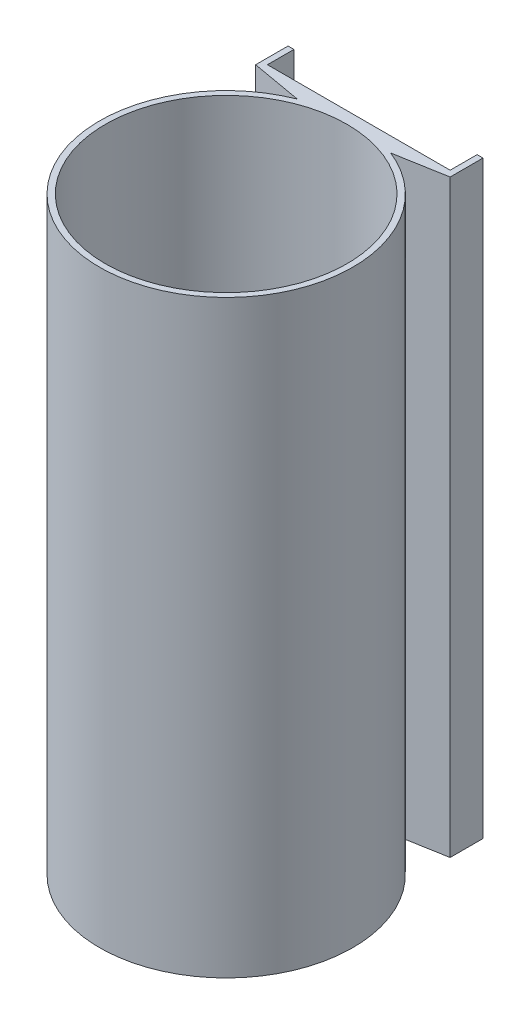
ISO-10303-21;
HEADER;
FILE_DESCRIPTION(('STEP AP214'),'2;1');
FILE_NAME('part.step','',(''),(''),'','','');
FILE_SCHEMA(('AUTOMOTIVE_DESIGN { 1 0 10303 214 1 1 1 1 }'));
ENDSEC;
DATA;
#1=APPLICATION_CONTEXT('core data for automotive mechanical design processes');
#2=APPLICATION_PROTOCOL_DEFINITION('international standard','automotive_design',2000,#1);
#3=PRODUCT_CONTEXT('',#1,'mechanical');
#4=PRODUCT('Part','Part','',(#3));
#5=PRODUCT_RELATED_PRODUCT_CATEGORY('part','',(#4));
#6=PRODUCT_DEFINITION_FORMATION('','',#4);
#7=PRODUCT_DEFINITION_CONTEXT('part definition',#1,'design');
#8=PRODUCT_DEFINITION('design','',#6,#7);
#9=PRODUCT_DEFINITION_SHAPE('','',#8);
#10=(LENGTH_UNIT() NAMED_UNIT(*) SI_UNIT(.MILLI.,.METRE.));
#11=(NAMED_UNIT(*) PLANE_ANGLE_UNIT() SI_UNIT($,.RADIAN.));
#12=(NAMED_UNIT(*) SI_UNIT($,.STERADIAN.) SOLID_ANGLE_UNIT());
#13=UNCERTAINTY_MEASURE_WITH_UNIT(LENGTH_MEASURE(1.E-05),#10,'distance_accuracy_value','');
#14=(GEOMETRIC_REPRESENTATION_CONTEXT(3) GLOBAL_UNCERTAINTY_ASSIGNED_CONTEXT((#13)) GLOBAL_UNIT_ASSIGNED_CONTEXT((#10,
#11,#12)) REPRESENTATION_CONTEXT('',''));
#15=CARTESIAN_POINT('',(0.,0.,0.));
#16=DIRECTION('',(0.,0.,1.));
#17=DIRECTION('',(1.,0.,0.));
#18=AXIS2_PLACEMENT_3D('',#15,#16,#17);
#19=CARTESIAN_POINT('',(6.35836132446917,200.,-36.0600589820238));
#20=DIRECTION('',(0.173648177666924,0.,-0.984807753012209));
#21=DIRECTION('',(-0.984807753012209,0.,-0.173648177666924));
#22=AXIS2_PLACEMENT_3D('',#19,#20,#21);
#23=PLANE('',#22);
#24=DIRECTION('',(0.984807753012209,0.,0.173648177666924));
#25=VECTOR('',#24,1.);
#26=CARTESIAN_POINT('',(6.35836132446917,0.,-36.0600589820238));
#27=LINE('',#26,#25);
#28=CARTESIAN_POINT('',(-33.,0.,-43.));
#29=VERTEX_POINT('',#28);
#30=CARTESIAN_POINT('',(-15.8433947801623,0.,-39.974827602379));
#31=VERTEX_POINT('',#30);
#32=EDGE_CURVE('E154',#29,#31,#27,.T.);
#33=ORIENTED_EDGE('',*,*,#32,.T.);
#34=DIRECTION('',(0.,-1.,0.));
#35=VECTOR('',#34,1.);
#36=CARTESIAN_POINT('',(-15.8433947801623,200.,-39.974827602379));
#37=LINE('',#36,#35);
#38=CARTESIAN_POINT('',(-15.8433947801623,200.,-39.974827602379));
#39=VERTEX_POINT('',#38);
#40=EDGE_CURVE('E11',#39,#31,#37,.T.);
#41=ORIENTED_EDGE('',*,*,#40,.F.);
#42=DIRECTION('',(0.984807753012209,0.,0.173648177666924));
#43=VECTOR('',#42,1.);
#44=CARTESIAN_POINT('',(6.35836132446917,200.,-36.0600589820238));
#45=LINE('',#44,#43);
#46=CARTESIAN_POINT('',(-33.,200.,-43.));
#47=VERTEX_POINT('',#46);
#48=EDGE_CURVE('E183',#47,#39,#45,.T.);
#49=ORIENTED_EDGE('',*,*,#48,.F.);
#50=DIRECTION('',(0.,-1.,0.));
#51=VECTOR('',#50,1.);
#52=CARTESIAN_POINT('',(-33.,200.,-43.));
#53=LINE('',#52,#51);
#54=EDGE_CURVE('E57',#47,#29,#53,.T.);
#55=ORIENTED_EDGE('',*,*,#54,.T.);
#56=EDGE_LOOP('',(#33,#41,#49,#55));
#57=FACE_BOUND('',#56,.T.);
#58=ADVANCED_FACE('F41',(#57),#23,.F.);
#59=CARTESIAN_POINT('',(0.,200.,0.));
#60=DIRECTION('',(0.,-1.,0.));
#61=DIRECTION('',(0.,0.,-1.));
#62=AXIS2_PLACEMENT_3D('',#59,#60,#61);
#63=CYLINDRICAL_SURFACE('',#62,43.);
#64=CARTESIAN_POINT('',(0.,0.,0.));
#65=DIRECTION('',(0.,1.,0.));
#66=DIRECTION('',(0.,0.,1.));
#67=AXIS2_PLACEMENT_3D('',#64,#65,#66);
#68=CIRCLE('',#67,43.);
#69=CARTESIAN_POINT('',(15.8433947801623,0.,-39.974827602379));
#70=VERTEX_POINT('',#69);
#71=EDGE_CURVE('E156',#31,#70,#68,.T.);
#72=ORIENTED_EDGE('',*,*,#71,.T.);
#73=DIRECTION('',(0.,-1.,0.));
#74=VECTOR('',#73,1.);
#75=CARTESIAN_POINT('',(15.8433947801623,200.,-39.974827602379));
#76=LINE('',#75,#74);
#77=CARTESIAN_POINT('',(15.8433947801623,200.,-39.974827602379));
#78=VERTEX_POINT('',#77);
#79=EDGE_CURVE('E49',#78,#70,#76,.T.);
#80=ORIENTED_EDGE('',*,*,#79,.F.);
#81=CARTESIAN_POINT('',(0.,200.,0.));
#82=DIRECTION('',(0.,1.,0.));
#83=DIRECTION('',(0.,0.,1.));
#84=AXIS2_PLACEMENT_3D('',#81,#82,#83);
#85=CIRCLE('',#84,43.);
#86=EDGE_CURVE('E101',#39,#78,#85,.T.);
#87=ORIENTED_EDGE('',*,*,#86,.F.);
#88=ORIENTED_EDGE('',*,*,#40,.T.);
#89=EDGE_LOOP('',(#72,#80,#87,#88));
#90=FACE_BOUND('',#89,.T.);
#91=ADVANCED_FACE('F200',(#90),#63,.T.);
#92=CARTESIAN_POINT('',(-6.35836132446918,200.,-36.0600589820238));
#93=DIRECTION('',(0.173648177666924,0.,0.984807753012209));
#94=DIRECTION('',(0.984807753012209,0.,-0.173648177666924));
#95=AXIS2_PLACEMENT_3D('',#92,#93,#94);
#96=PLANE('',#95);
#97=DIRECTION('',(-0.984807753012209,0.,0.173648177666924));
#98=VECTOR('',#97,1.);
#99=CARTESIAN_POINT('',(-6.35836132446918,0.,-36.0600589820238));
#100=LINE('',#99,#98);
#101=CARTESIAN_POINT('',(33.,0.,-43.));
#102=VERTEX_POINT('',#101);
#103=EDGE_CURVE('E159',#102,#70,#100,.T.);
#104=ORIENTED_EDGE('',*,*,#103,.F.);
#105=DIRECTION('',(0.,-1.,0.));
#106=VECTOR('',#105,1.);
#107=CARTESIAN_POINT('',(33.,200.,-43.));
#108=LINE('',#107,#106);
#109=CARTESIAN_POINT('',(33.,200.,-43.));
#110=VERTEX_POINT('',#109);
#111=EDGE_CURVE('E193',#110,#102,#108,.T.);
#112=ORIENTED_EDGE('',*,*,#111,.F.);
#113=DIRECTION('',(-0.984807753012209,0.,0.173648177666924));
#114=VECTOR('',#113,1.);
#115=CARTESIAN_POINT('',(-6.35836132446918,200.,-36.0600589820238));
#116=LINE('',#115,#114);
#117=EDGE_CURVE('E199',#110,#78,#116,.T.);
#118=ORIENTED_EDGE('',*,*,#117,.T.);
#119=ORIENTED_EDGE('',*,*,#79,.T.);
#120=EDGE_LOOP('',(#104,#112,#118,#119));
#121=FACE_BOUND('',#120,.T.);
#122=ADVANCED_FACE('F197',(#121),#96,.T.);
#123=CARTESIAN_POINT('',(33.,200.,0.));
#124=DIRECTION('',(-1.,0.,0.));
#125=DIRECTION('',(0.,0.,1.));
#126=AXIS2_PLACEMENT_3D('',#123,#124,#125);
#127=PLANE('',#126);
#128=DIRECTION('',(0.,0.,-1.));
#129=VECTOR('',#128,1.);
#130=CARTESIAN_POINT('',(33.,0.,0.));
#131=LINE('',#130,#129);
#132=CARTESIAN_POINT('',(33.,0.,-54.1590723886463));
#133=VERTEX_POINT('',#132);
#134=EDGE_CURVE('E162',#102,#133,#131,.T.);
#135=ORIENTED_EDGE('',*,*,#134,.T.);
#136=DIRECTION('',(0.,-1.,0.));
#137=VECTOR('',#136,1.);
#138=CARTESIAN_POINT('',(33.,200.,-54.1590723886463));
#139=LINE('',#138,#137);
#140=CARTESIAN_POINT('',(33.,200.,-54.1590723886463));
#141=VERTEX_POINT('',#140);
#142=EDGE_CURVE('E191',#141,#133,#139,.T.);
#143=ORIENTED_EDGE('',*,*,#142,.F.);
#144=DIRECTION('',(0.,0.,-1.));
#145=VECTOR('',#144,1.);
#146=CARTESIAN_POINT('',(33.,200.,0.));
#147=LINE('',#146,#145);
#148=EDGE_CURVE('E212',#110,#141,#147,.T.);
#149=ORIENTED_EDGE('',*,*,#148,.F.);
#150=ORIENTED_EDGE('',*,*,#111,.T.);
#151=EDGE_LOOP('',(#135,#143,#149,#150));
#152=FACE_BOUND('',#151,.T.);
#153=ADVANCED_FACE('F209',(#152),#127,.F.);
#154=CARTESIAN_POINT('',(0.,200.,-54.1590723886463));
#155=DIRECTION('',(0.,0.,-1.));
#156=DIRECTION('',(-1.,0.,0.));
#157=AXIS2_PLACEMENT_3D('',#154,#155,#156);
#158=PLANE('',#157);
#159=DIRECTION('',(1.,0.,0.));
#160=VECTOR('',#159,1.);
#161=CARTESIAN_POINT('',(0.,0.,-54.1590723886463));
#162=LINE('',#161,#160);
#163=CARTESIAN_POINT('',(31.,0.,-54.1590723886463));
#164=VERTEX_POINT('',#163);
#165=EDGE_CURVE('E165',#164,#133,#162,.T.);
#166=ORIENTED_EDGE('',*,*,#165,.F.);
#167=DIRECTION('',(0.,-1.,0.));
#168=VECTOR('',#167,1.);
#169=CARTESIAN_POINT('',(31.,200.,-54.1590723886463));
#170=LINE('',#169,#168);
#171=CARTESIAN_POINT('',(31.,200.,-54.1590723886463));
#172=VERTEX_POINT('',#171);
#173=EDGE_CURVE('E189',#172,#164,#170,.T.);
#174=ORIENTED_EDGE('',*,*,#173,.F.);
#175=DIRECTION('',(1.,0.,0.));
#176=VECTOR('',#175,1.);
#177=CARTESIAN_POINT('',(0.,200.,-54.1590723886463));
#178=LINE('',#177,#176);
#179=EDGE_CURVE('E214',#172,#141,#178,.T.);
#180=ORIENTED_EDGE('',*,*,#179,.T.);
#181=ORIENTED_EDGE('',*,*,#142,.T.);
#182=EDGE_LOOP('',(#166,#174,#180,#181));
#183=FACE_BOUND('',#182,.T.);
#184=ADVANCED_FACE('F249',(#183),#158,.T.);
#185=CARTESIAN_POINT('',(31.,200.,0.));
#186=DIRECTION('',(-1.,0.,0.));
#187=DIRECTION('',(0.,0.,1.));
#188=AXIS2_PLACEMENT_3D('',#185,#186,#187);
#189=PLANE('',#188);
#190=DIRECTION('',(0.,0.,-1.));
#191=VECTOR('',#190,1.);
#192=CARTESIAN_POINT('',(31.,0.,0.));
#193=LINE('',#192,#191);
#194=CARTESIAN_POINT('',(31.,0.,-45.));
#195=VERTEX_POINT('',#194);
#196=EDGE_CURVE('E168',#195,#164,#193,.T.);
#197=ORIENTED_EDGE('',*,*,#196,.F.);
#198=DIRECTION('',(0.,-1.,0.));
#199=VECTOR('',#198,1.);
#200=CARTESIAN_POINT('',(31.,200.,-45.));
#201=LINE('',#200,#199);
#202=CARTESIAN_POINT('',(31.,200.,-45.));
#203=VERTEX_POINT('',#202);
#204=EDGE_CURVE('E187',#203,#195,#201,.T.);
#205=ORIENTED_EDGE('',*,*,#204,.F.);
#206=DIRECTION('',(0.,0.,-1.));
#207=VECTOR('',#206,1.);
#208=CARTESIAN_POINT('',(31.,200.,0.));
#209=LINE('',#208,#207);
#210=EDGE_CURVE('E221',#203,#172,#209,.T.);
#211=ORIENTED_EDGE('',*,*,#210,.T.);
#212=ORIENTED_EDGE('',*,*,#173,.T.);
#213=EDGE_LOOP('',(#197,#205,#211,#212));
#214=FACE_BOUND('',#213,.T.);
#215=ADVANCED_FACE('F252',(#214),#189,.T.);
#216=CARTESIAN_POINT('',(0.,200.,-45.));
#217=DIRECTION('',(0.,0.,-1.));
#218=DIRECTION('',(-1.,0.,0.));
#219=AXIS2_PLACEMENT_3D('',#216,#217,#218);
#220=PLANE('',#219);
#221=DIRECTION('',(1.,0.,0.));
#222=VECTOR('',#221,1.);
#223=CARTESIAN_POINT('',(0.,0.,-45.));
#224=LINE('',#223,#222);
#225=CARTESIAN_POINT('',(-31.,0.,-45.));
#226=VERTEX_POINT('',#225);
#227=EDGE_CURVE('E171',#226,#195,#224,.T.);
#228=ORIENTED_EDGE('',*,*,#227,.F.);
#229=DIRECTION('',(0.,-1.,0.));
#230=VECTOR('',#229,1.);
#231=CARTESIAN_POINT('',(-31.,200.,-45.));
#232=LINE('',#231,#230);
#233=CARTESIAN_POINT('',(-31.,200.,-45.));
#234=VERTEX_POINT('',#233);
#235=EDGE_CURVE('E132',#234,#226,#232,.T.);
#236=ORIENTED_EDGE('',*,*,#235,.F.);
#237=DIRECTION('',(1.,0.,0.));
#238=VECTOR('',#237,1.);
#239=CARTESIAN_POINT('',(0.,200.,-45.));
#240=LINE('',#239,#238);
#241=EDGE_CURVE('E143',#234,#203,#240,.T.);
#242=ORIENTED_EDGE('',*,*,#241,.T.);
#243=ORIENTED_EDGE('',*,*,#204,.T.);
#244=EDGE_LOOP('',(#228,#236,#242,#243));
#245=FACE_BOUND('',#244,.T.);
#246=ADVANCED_FACE('F225',(#245),#220,.T.);
#247=CARTESIAN_POINT('',(-31.,200.,0.));
#248=DIRECTION('',(1.,0.,0.));
#249=DIRECTION('',(0.,0.,-1.));
#250=AXIS2_PLACEMENT_3D('',#247,#248,#249);
#251=PLANE('',#250);
#252=DIRECTION('',(0.,0.,1.));
#253=VECTOR('',#252,1.);
#254=CARTESIAN_POINT('',(-31.,0.,0.));
#255=LINE('',#254,#253);
#256=CARTESIAN_POINT('',(-31.,0.,-54.));
#257=VERTEX_POINT('',#256);
#258=EDGE_CURVE('E128',#257,#226,#255,.T.);
#259=ORIENTED_EDGE('',*,*,#258,.F.);
#260=DIRECTION('',(0.,-1.,0.));
#261=VECTOR('',#260,1.);
#262=CARTESIAN_POINT('',(-31.,200.,-54.));
#263=LINE('',#262,#261);
#264=CARTESIAN_POINT('',(-31.,200.,-54.));
#265=VERTEX_POINT('',#264);
#266=EDGE_CURVE('E123',#265,#257,#263,.T.);
#267=ORIENTED_EDGE('',*,*,#266,.F.);
#268=DIRECTION('',(0.,0.,1.));
#269=VECTOR('',#268,1.);
#270=CARTESIAN_POINT('',(-31.,200.,0.));
#271=LINE('',#270,#269);
#272=EDGE_CURVE('E126',#265,#234,#271,.T.);
#273=ORIENTED_EDGE('',*,*,#272,.T.);
#274=ORIENTED_EDGE('',*,*,#235,.T.);
#275=EDGE_LOOP('',(#259,#267,#273,#274));
#276=FACE_BOUND('',#275,.T.);
#277=ADVANCED_FACE('F125',(#276),#251,.T.);
#278=CARTESIAN_POINT('',(0.,200.,-54.));
#279=DIRECTION('',(0.,0.,-1.));
#280=DIRECTION('',(-1.,0.,0.));
#281=AXIS2_PLACEMENT_3D('',#278,#279,#280);
#282=PLANE('',#281);
#283=DIRECTION('',(1.,0.,0.));
#284=VECTOR('',#283,1.);
#285=CARTESIAN_POINT('',(0.,0.,-54.));
#286=LINE('',#285,#284);
#287=CARTESIAN_POINT('',(-33.,0.,-54.));
#288=VERTEX_POINT('',#287);
#289=EDGE_CURVE('E175',#288,#257,#286,.T.);
#290=ORIENTED_EDGE('',*,*,#289,.F.);
#291=DIRECTION('',(0.,-1.,0.));
#292=VECTOR('',#291,1.);
#293=CARTESIAN_POINT('',(-33.,200.,-54.));
#294=LINE('',#293,#292);
#295=CARTESIAN_POINT('',(-33.,200.,-54.));
#296=VERTEX_POINT('',#295);
#297=EDGE_CURVE('E89',#296,#288,#294,.T.);
#298=ORIENTED_EDGE('',*,*,#297,.F.);
#299=DIRECTION('',(1.,0.,0.));
#300=VECTOR('',#299,1.);
#301=CARTESIAN_POINT('',(0.,200.,-54.));
#302=LINE('',#301,#300);
#303=EDGE_CURVE('E140',#296,#265,#302,.T.);
#304=ORIENTED_EDGE('',*,*,#303,.T.);
#305=ORIENTED_EDGE('',*,*,#266,.T.);
#306=EDGE_LOOP('',(#290,#298,#304,#305));
#307=FACE_BOUND('',#306,.T.);
#308=ADVANCED_FACE('F145',(#307),#282,.T.);
#309=CARTESIAN_POINT('',(-33.,200.,0.));
#310=DIRECTION('',(-1.,0.,0.));
#311=DIRECTION('',(0.,0.,1.));
#312=AXIS2_PLACEMENT_3D('',#309,#310,#311);
#313=PLANE('',#312);
#314=DIRECTION('',(0.,0.,-1.));
#315=VECTOR('',#314,1.);
#316=CARTESIAN_POINT('',(-33.,0.,0.));
#317=LINE('',#316,#315);
#318=EDGE_CURVE('E177',#29,#288,#317,.T.);
#319=ORIENTED_EDGE('',*,*,#318,.F.);
#320=ORIENTED_EDGE('',*,*,#54,.F.);
#321=DIRECTION('',(0.,0.,-1.));
#322=VECTOR('',#321,1.);
#323=CARTESIAN_POINT('',(-33.,200.,0.));
#324=LINE('',#323,#322);
#325=EDGE_CURVE('E146',#47,#296,#324,.T.);
#326=ORIENTED_EDGE('',*,*,#325,.T.);
#327=ORIENTED_EDGE('',*,*,#297,.T.);
#328=EDGE_LOOP('',(#319,#320,#326,#327));
#329=FACE_BOUND('',#328,.T.);
#330=ADVANCED_FACE('F227',(#329),#313,.T.);
#331=CARTESIAN_POINT('',(0.,200.,0.));
#332=DIRECTION('',(0.,-1.,0.));
#333=DIRECTION('',(0.,0.,-1.));
#334=AXIS2_PLACEMENT_3D('',#331,#332,#333);
#335=CYLINDRICAL_SURFACE('',#334,41.);
#336=CARTESIAN_POINT('',(0.,200.,0.));
#337=DIRECTION('',(0.,1.,0.));
#338=DIRECTION('',(0.,0.,1.));
#339=AXIS2_PLACEMENT_3D('',#336,#337,#338);
#340=CIRCLE('',#339,41.);
#341=CARTESIAN_POINT('',(0.,200.,41.));
#342=VERTEX_POINT('',#341);
#343=EDGE_CURVE('E148',#342,#342,#340,.T.);
#344=ORIENTED_EDGE('',*,*,#343,.T.);
#345=EDGE_LOOP('',(#344));
#346=FACE_BOUND('',#345,.T.);
#347=CARTESIAN_POINT('',(0.,0.,0.));
#348=DIRECTION('',(0.,1.,0.));
#349=DIRECTION('',(0.,0.,1.));
#350=AXIS2_PLACEMENT_3D('',#347,#348,#349);
#351=CIRCLE('',#350,41.);
#352=CARTESIAN_POINT('',(0.,0.,41.));
#353=VERTEX_POINT('',#352);
#354=EDGE_CURVE('E180',#353,#353,#351,.T.);
#355=ORIENTED_EDGE('',*,*,#354,.F.);
#356=EDGE_LOOP('',(#355));
#357=FACE_BOUND('',#356,.T.);
#358=ADVANCED_FACE('F229',(#346,#357),#335,.F.);
#359=CARTESIAN_POINT('',(0.,200.,0.));
#360=DIRECTION('',(0.,1.,0.));
#361=DIRECTION('',(0.,0.,1.));
#362=AXIS2_PLACEMENT_3D('',#359,#360,#361);
#363=PLANE('',#362);
#364=ORIENTED_EDGE('',*,*,#48,.T.);
#365=ORIENTED_EDGE('',*,*,#86,.T.);
#366=ORIENTED_EDGE('',*,*,#117,.F.);
#367=ORIENTED_EDGE('',*,*,#148,.T.);
#368=ORIENTED_EDGE('',*,*,#179,.F.);
#369=ORIENTED_EDGE('',*,*,#210,.F.);
#370=ORIENTED_EDGE('',*,*,#241,.F.);
#371=ORIENTED_EDGE('',*,*,#272,.F.);
#372=ORIENTED_EDGE('',*,*,#303,.F.);
#373=ORIENTED_EDGE('',*,*,#325,.F.);
#374=EDGE_LOOP('',(#364,#365,#366,#367,#368,#369,#370,#371,#372,#373));
#375=FACE_BOUND('',#374,.T.);
#376=ORIENTED_EDGE('',*,*,#343,.F.);
#377=EDGE_LOOP('',(#376));
#378=FACE_BOUND('',#377,.T.);
#379=ADVANCED_FACE('F137',(#375,#378),#363,.T.);
#380=CARTESIAN_POINT('',(0.,0.,0.));
#381=DIRECTION('',(0.,1.,0.));
#382=DIRECTION('',(0.,0.,1.));
#383=AXIS2_PLACEMENT_3D('',#380,#381,#382);
#384=PLANE('',#383);
#385=ORIENTED_EDGE('',*,*,#32,.F.);
#386=ORIENTED_EDGE('',*,*,#318,.T.);
#387=ORIENTED_EDGE('',*,*,#289,.T.);
#388=ORIENTED_EDGE('',*,*,#258,.T.);
#389=ORIENTED_EDGE('',*,*,#227,.T.);
#390=ORIENTED_EDGE('',*,*,#196,.T.);
#391=ORIENTED_EDGE('',*,*,#165,.T.);
#392=ORIENTED_EDGE('',*,*,#134,.F.);
#393=ORIENTED_EDGE('',*,*,#103,.T.);
#394=ORIENTED_EDGE('',*,*,#71,.F.);
#395=EDGE_LOOP('',(#385,#386,#387,#388,#389,#390,#391,#392,#393,#394));
#396=FACE_BOUND('',#395,.T.);
#397=ORIENTED_EDGE('',*,*,#354,.T.);
#398=EDGE_LOOP('',(#397));
#399=FACE_BOUND('',#398,.T.);
#400=ADVANCED_FACE('F204',(#396,#399),#384,.F.);
#401=CLOSED_SHELL('',(#58,#91,#122,#153,#184,#215,#246,#277,#308,#330,#358,#379,#400));
#402=MANIFOLD_SOLID_BREP('B2',#401);
#403=ADVANCED_BREP_SHAPE_REPRESENTATION('',(#18,#402),#14);
#404=SHAPE_DEFINITION_REPRESENTATION(#9,#403);
ENDSEC;
END-ISO-10303-21;
